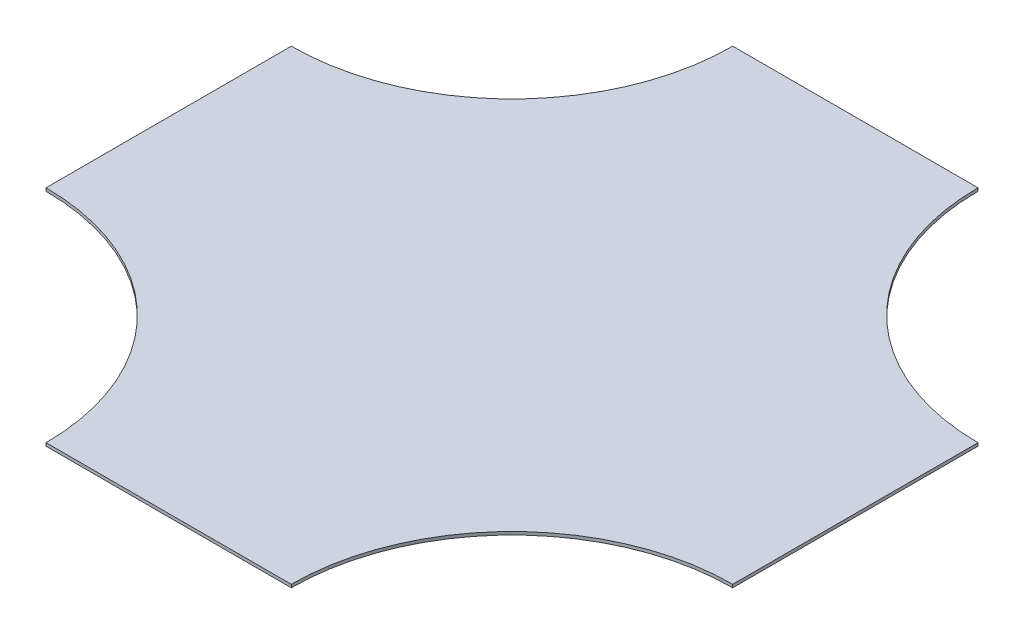
ISO-10303-21;
HEADER;
FILE_DESCRIPTION(('STEP AP214'),'2;1');
FILE_NAME('part.step','',(''),(''),'','','');
FILE_SCHEMA(('AUTOMOTIVE_DESIGN { 1 0 10303 214 1 1 1 1 }'));
ENDSEC;
DATA;
#1=APPLICATION_CONTEXT('core data for automotive mechanical design processes');
#2=APPLICATION_PROTOCOL_DEFINITION('international standard','automotive_design',2000,#1);
#3=PRODUCT_CONTEXT('',#1,'mechanical');
#4=PRODUCT('Part','Part','',(#3));
#5=PRODUCT_RELATED_PRODUCT_CATEGORY('part','',(#4));
#6=PRODUCT_DEFINITION_FORMATION('','',#4);
#7=PRODUCT_DEFINITION_CONTEXT('part definition',#1,'design');
#8=PRODUCT_DEFINITION('design','',#6,#7);
#9=PRODUCT_DEFINITION_SHAPE('','',#8);
#10=(LENGTH_UNIT() NAMED_UNIT(*) SI_UNIT(.MILLI.,.METRE.));
#11=(NAMED_UNIT(*) PLANE_ANGLE_UNIT() SI_UNIT($,.RADIAN.));
#12=(NAMED_UNIT(*) SI_UNIT($,.STERADIAN.) SOLID_ANGLE_UNIT());
#13=UNCERTAINTY_MEASURE_WITH_UNIT(LENGTH_MEASURE(1.E-05),#10,'distance_accuracy_value','');
#14=(GEOMETRIC_REPRESENTATION_CONTEXT(3) GLOBAL_UNCERTAINTY_ASSIGNED_CONTEXT((#13)) GLOBAL_UNIT_ASSIGNED_CONTEXT((#10,
#11,#12)) REPRESENTATION_CONTEXT('',''));
#15=CARTESIAN_POINT('',(0.,0.,0.));
#16=DIRECTION('',(0.,0.,1.));
#17=DIRECTION('',(1.,0.,0.));
#18=AXIS2_PLACEMENT_3D('',#15,#16,#17);
#19=CARTESIAN_POINT('',(-355.6,3.175,-355.6));
#20=DIRECTION('',(0.,-1.,0.));
#21=DIRECTION('',(0.,0.,-1.));
#22=AXIS2_PLACEMENT_3D('',#19,#20,#21);
#23=CYLINDRICAL_SURFACE('',#22,228.6);
#24=CARTESIAN_POINT('',(-355.6,0.,-355.6));
#25=DIRECTION('',(0.,-1.,0.));
#26=DIRECTION('',(0.,0.,1.));
#27=AXIS2_PLACEMENT_3D('',#24,#25,#26);
#28=CIRCLE('',#27,228.6);
#29=CARTESIAN_POINT('',(-127.,0.,-355.6));
#30=VERTEX_POINT('',#29);
#31=CARTESIAN_POINT('',(-355.6,0.,-127.));
#32=VERTEX_POINT('',#31);
#33=EDGE_CURVE('E131',#30,#32,#28,.T.);
#34=ORIENTED_EDGE('',*,*,#33,.T.);
#35=DIRECTION('',(0.,-1.,0.));
#36=VECTOR('',#35,1.);
#37=CARTESIAN_POINT('',(-355.6,3.175,-127.));
#38=LINE('',#37,#36);
#39=CARTESIAN_POINT('',(-355.6,3.175,-127.));
#40=VERTEX_POINT('',#39);
#41=EDGE_CURVE('E11',#40,#32,#38,.T.);
#42=ORIENTED_EDGE('',*,*,#41,.F.);
#43=CARTESIAN_POINT('',(-355.6,3.175,-355.6));
#44=DIRECTION('',(0.,-1.,0.));
#45=DIRECTION('',(0.,0.,1.));
#46=AXIS2_PLACEMENT_3D('',#43,#44,#45);
#47=CIRCLE('',#46,228.6);
#48=CARTESIAN_POINT('',(-127.,3.175,-355.6));
#49=VERTEX_POINT('',#48);
#50=EDGE_CURVE('E145',#49,#40,#47,.T.);
#51=ORIENTED_EDGE('',*,*,#50,.F.);
#52=DIRECTION('',(0.,-1.,0.));
#53=VECTOR('',#52,1.);
#54=CARTESIAN_POINT('',(-127.,3.175,-355.6));
#55=LINE('',#54,#53);
#56=EDGE_CURVE('E127',#49,#30,#55,.T.);
#57=ORIENTED_EDGE('',*,*,#56,.T.);
#58=EDGE_LOOP('',(#34,#42,#51,#57));
#59=FACE_BOUND('',#58,.T.);
#60=ADVANCED_FACE('F35',(#59),#23,.F.);
#61=CARTESIAN_POINT('',(-355.6,3.175,127.));
#62=DIRECTION('',(1.,0.,0.));
#63=DIRECTION('',(0.,0.,-1.));
#64=AXIS2_PLACEMENT_3D('',#61,#62,#63);
#65=PLANE('',#64);
#66=DIRECTION('',(0.,0.,1.));
#67=VECTOR('',#66,1.);
#68=CARTESIAN_POINT('',(-355.6,0.,127.));
#69=LINE('',#68,#67);
#70=CARTESIAN_POINT('',(-355.6,0.,127.));
#71=VERTEX_POINT('',#70);
#72=EDGE_CURVE('E134',#32,#71,#69,.T.);
#73=ORIENTED_EDGE('',*,*,#72,.T.);
#74=DIRECTION('',(0.,-1.,0.));
#75=VECTOR('',#74,1.);
#76=CARTESIAN_POINT('',(-355.6,3.175,127.));
#77=LINE('',#76,#75);
#78=CARTESIAN_POINT('',(-355.6,3.175,127.));
#79=VERTEX_POINT('',#78);
#80=EDGE_CURVE('E43',#79,#71,#77,.T.);
#81=ORIENTED_EDGE('',*,*,#80,.F.);
#82=DIRECTION('',(0.,0.,1.));
#83=VECTOR('',#82,1.);
#84=CARTESIAN_POINT('',(-355.6,3.175,127.));
#85=LINE('',#84,#83);
#86=EDGE_CURVE('E94',#40,#79,#85,.T.);
#87=ORIENTED_EDGE('',*,*,#86,.F.);
#88=ORIENTED_EDGE('',*,*,#41,.T.);
#89=EDGE_LOOP('',(#73,#81,#87,#88));
#90=FACE_BOUND('',#89,.T.);
#91=ADVANCED_FACE('F180',(#90),#65,.F.);
#92=CARTESIAN_POINT('',(-355.6,3.175,355.6));
#93=DIRECTION('',(0.,-1.,0.));
#94=DIRECTION('',(0.,0.,-1.));
#95=AXIS2_PLACEMENT_3D('',#92,#93,#94);
#96=CYLINDRICAL_SURFACE('',#95,228.6);
#97=CARTESIAN_POINT('',(-355.6,0.,355.6));
#98=DIRECTION('',(0.,-1.,0.));
#99=DIRECTION('',(0.,0.,1.));
#100=AXIS2_PLACEMENT_3D('',#97,#98,#99);
#101=CIRCLE('',#100,228.6);
#102=CARTESIAN_POINT('',(-127.,0.,355.6));
#103=VERTEX_POINT('',#102);
#104=EDGE_CURVE('E136',#71,#103,#101,.T.);
#105=ORIENTED_EDGE('',*,*,#104,.T.);
#106=DIRECTION('',(0.,-1.,0.));
#107=VECTOR('',#106,1.);
#108=CARTESIAN_POINT('',(-127.,3.175,355.6));
#109=LINE('',#108,#107);
#110=CARTESIAN_POINT('',(-127.,3.175,355.6));
#111=VERTEX_POINT('',#110);
#112=EDGE_CURVE('E152',#111,#103,#109,.T.);
#113=ORIENTED_EDGE('',*,*,#112,.F.);
#114=CARTESIAN_POINT('',(-355.6,3.175,355.6));
#115=DIRECTION('',(0.,-1.,0.));
#116=DIRECTION('',(0.,0.,1.));
#117=AXIS2_PLACEMENT_3D('',#114,#115,#116);
#118=CIRCLE('',#117,228.6);
#119=EDGE_CURVE('E160',#79,#111,#118,.T.);
#120=ORIENTED_EDGE('',*,*,#119,.F.);
#121=ORIENTED_EDGE('',*,*,#80,.T.);
#122=EDGE_LOOP('',(#105,#113,#120,#121));
#123=FACE_BOUND('',#122,.T.);
#124=ADVANCED_FACE('F158',(#123),#96,.F.);
#125=CARTESIAN_POINT('',(-127.,3.175,355.6));
#126=DIRECTION('',(0.,0.,-1.));
#127=DIRECTION('',(-1.,0.,0.));
#128=AXIS2_PLACEMENT_3D('',#125,#126,#127);
#129=PLANE('',#128);
#130=DIRECTION('',(1.,0.,0.));
#131=VECTOR('',#130,1.);
#132=CARTESIAN_POINT('',(-127.,0.,355.6));
#133=LINE('',#132,#131);
#134=CARTESIAN_POINT('',(127.,0.,355.6));
#135=VERTEX_POINT('',#134);
#136=EDGE_CURVE('E138',#103,#135,#133,.T.);
#137=ORIENTED_EDGE('',*,*,#136,.T.);
#138=DIRECTION('',(0.,-1.,0.));
#139=VECTOR('',#138,1.);
#140=CARTESIAN_POINT('',(127.,3.175,355.6));
#141=LINE('',#140,#139);
#142=CARTESIAN_POINT('',(127.,3.175,355.6));
#143=VERTEX_POINT('',#142);
#144=EDGE_CURVE('E149',#143,#135,#141,.T.);
#145=ORIENTED_EDGE('',*,*,#144,.F.);
#146=DIRECTION('',(1.,0.,0.));
#147=VECTOR('',#146,1.);
#148=CARTESIAN_POINT('',(-127.,3.175,355.6));
#149=LINE('',#148,#147);
#150=EDGE_CURVE('E172',#111,#143,#149,.T.);
#151=ORIENTED_EDGE('',*,*,#150,.F.);
#152=ORIENTED_EDGE('',*,*,#112,.T.);
#153=EDGE_LOOP('',(#137,#145,#151,#152));
#154=FACE_BOUND('',#153,.T.);
#155=ADVANCED_FACE('F168',(#154),#129,.F.);
#156=CARTESIAN_POINT('',(355.6,3.175,355.6));
#157=DIRECTION('',(0.,-1.,0.));
#158=DIRECTION('',(0.,0.,-1.));
#159=AXIS2_PLACEMENT_3D('',#156,#157,#158);
#160=CYLINDRICAL_SURFACE('',#159,228.6);
#161=CARTESIAN_POINT('',(355.6,0.,355.6));
#162=DIRECTION('',(0.,-1.,0.));
#163=DIRECTION('',(0.,0.,1.));
#164=AXIS2_PLACEMENT_3D('',#161,#162,#163);
#165=CIRCLE('',#164,228.6);
#166=CARTESIAN_POINT('',(355.6,0.,127.));
#167=VERTEX_POINT('',#166);
#168=EDGE_CURVE('E140',#135,#167,#165,.T.);
#169=ORIENTED_EDGE('',*,*,#168,.T.);
#170=DIRECTION('',(0.,-1.,0.));
#171=VECTOR('',#170,1.);
#172=CARTESIAN_POINT('',(355.6,3.175,127.));
#173=LINE('',#172,#171);
#174=CARTESIAN_POINT('',(355.6,3.175,127.));
#175=VERTEX_POINT('',#174);
#176=EDGE_CURVE('E122',#175,#167,#173,.T.);
#177=ORIENTED_EDGE('',*,*,#176,.F.);
#178=CARTESIAN_POINT('',(355.6,3.175,355.6));
#179=DIRECTION('',(0.,-1.,0.));
#180=DIRECTION('',(0.,0.,1.));
#181=AXIS2_PLACEMENT_3D('',#178,#179,#180);
#182=CIRCLE('',#181,228.6);
#183=EDGE_CURVE('E113',#143,#175,#182,.T.);
#184=ORIENTED_EDGE('',*,*,#183,.F.);
#185=ORIENTED_EDGE('',*,*,#144,.T.);
#186=EDGE_LOOP('',(#169,#177,#184,#185));
#187=FACE_BOUND('',#186,.T.);
#188=ADVANCED_FACE('F171',(#187),#160,.F.);
#189=CARTESIAN_POINT('',(355.6,3.175,127.));
#190=DIRECTION('',(-1.,0.,0.));
#191=DIRECTION('',(0.,0.,1.));
#192=AXIS2_PLACEMENT_3D('',#189,#190,#191);
#193=PLANE('',#192);
#194=DIRECTION('',(0.,0.,-1.));
#195=VECTOR('',#194,1.);
#196=CARTESIAN_POINT('',(355.6,0.,127.));
#197=LINE('',#196,#195);
#198=CARTESIAN_POINT('',(355.6,0.,-127.));
#199=VERTEX_POINT('',#198);
#200=EDGE_CURVE('E121',#167,#199,#197,.T.);
#201=ORIENTED_EDGE('',*,*,#200,.T.);
#202=DIRECTION('',(0.,-1.,0.));
#203=VECTOR('',#202,1.);
#204=CARTESIAN_POINT('',(355.6,3.175,-127.));
#205=LINE('',#204,#203);
#206=CARTESIAN_POINT('',(355.6,3.175,-127.));
#207=VERTEX_POINT('',#206);
#208=EDGE_CURVE('E118',#207,#199,#205,.T.);
#209=ORIENTED_EDGE('',*,*,#208,.F.);
#210=DIRECTION('',(0.,0.,-1.));
#211=VECTOR('',#210,1.);
#212=CARTESIAN_POINT('',(355.6,3.175,127.));
#213=LINE('',#212,#211);
#214=EDGE_CURVE('E107',#175,#207,#213,.T.);
#215=ORIENTED_EDGE('',*,*,#214,.F.);
#216=ORIENTED_EDGE('',*,*,#176,.T.);
#217=EDGE_LOOP('',(#201,#209,#215,#216));
#218=FACE_BOUND('',#217,.T.);
#219=ADVANCED_FACE('F119',(#218),#193,.F.);
#220=CARTESIAN_POINT('',(355.6,3.175,-355.6));
#221=DIRECTION('',(0.,-1.,0.));
#222=DIRECTION('',(0.,0.,-1.));
#223=AXIS2_PLACEMENT_3D('',#220,#221,#222);
#224=CYLINDRICAL_SURFACE('',#223,228.6);
#225=CARTESIAN_POINT('',(355.6,0.,-355.6));
#226=DIRECTION('',(0.,-1.,0.));
#227=DIRECTION('',(0.,0.,1.));
#228=AXIS2_PLACEMENT_3D('',#225,#226,#227);
#229=CIRCLE('',#228,228.6);
#230=CARTESIAN_POINT('',(127.,0.,-355.6));
#231=VERTEX_POINT('',#230);
#232=EDGE_CURVE('E80',#199,#231,#229,.T.);
#233=ORIENTED_EDGE('',*,*,#232,.T.);
#234=DIRECTION('',(0.,-1.,0.));
#235=VECTOR('',#234,1.);
#236=CARTESIAN_POINT('',(127.,3.175,-355.6));
#237=LINE('',#236,#235);
#238=CARTESIAN_POINT('',(127.,3.175,-355.6));
#239=VERTEX_POINT('',#238);
#240=EDGE_CURVE('E123',#239,#231,#237,.T.);
#241=ORIENTED_EDGE('',*,*,#240,.F.);
#242=CARTESIAN_POINT('',(355.6,3.175,-355.6));
#243=DIRECTION('',(0.,-1.,0.));
#244=DIRECTION('',(0.,0.,1.));
#245=AXIS2_PLACEMENT_3D('',#242,#243,#244);
#246=CIRCLE('',#245,228.6);
#247=EDGE_CURVE('E111',#207,#239,#246,.T.);
#248=ORIENTED_EDGE('',*,*,#247,.F.);
#249=ORIENTED_EDGE('',*,*,#208,.T.);
#250=EDGE_LOOP('',(#233,#241,#248,#249));
#251=FACE_BOUND('',#250,.T.);
#252=ADVANCED_FACE('F125',(#251),#224,.F.);
#253=CARTESIAN_POINT('',(-127.,3.175,-355.6));
#254=DIRECTION('',(0.,0.,1.));
#255=DIRECTION('',(1.,0.,0.));
#256=AXIS2_PLACEMENT_3D('',#253,#254,#255);
#257=PLANE('',#256);
#258=DIRECTION('',(-1.,0.,0.));
#259=VECTOR('',#258,1.);
#260=CARTESIAN_POINT('',(-127.,0.,-355.6));
#261=LINE('',#260,#259);
#262=EDGE_CURVE('E86',#231,#30,#261,.T.);
#263=ORIENTED_EDGE('',*,*,#262,.T.);
#264=ORIENTED_EDGE('',*,*,#56,.F.);
#265=DIRECTION('',(-1.,0.,0.));
#266=VECTOR('',#265,1.);
#267=CARTESIAN_POINT('',(-127.,3.175,-355.6));
#268=LINE('',#267,#266);
#269=EDGE_CURVE('E51',#239,#49,#268,.T.);
#270=ORIENTED_EDGE('',*,*,#269,.F.);
#271=ORIENTED_EDGE('',*,*,#240,.T.);
#272=EDGE_LOOP('',(#263,#264,#270,#271));
#273=FACE_BOUND('',#272,.T.);
#274=ADVANCED_FACE('F196',(#273),#257,.F.);
#275=CARTESIAN_POINT('',(-355.6,3.175,-355.6));
#276=DIRECTION('',(0.,1.,0.));
#277=DIRECTION('',(0.,0.,1.));
#278=AXIS2_PLACEMENT_3D('',#275,#276,#277);
#279=PLANE('',#278);
#280=ORIENTED_EDGE('',*,*,#50,.T.);
#281=ORIENTED_EDGE('',*,*,#86,.T.);
#282=ORIENTED_EDGE('',*,*,#119,.T.);
#283=ORIENTED_EDGE('',*,*,#150,.T.);
#284=ORIENTED_EDGE('',*,*,#183,.T.);
#285=ORIENTED_EDGE('',*,*,#214,.T.);
#286=ORIENTED_EDGE('',*,*,#247,.T.);
#287=ORIENTED_EDGE('',*,*,#269,.T.);
#288=EDGE_LOOP('',(#280,#281,#282,#283,#284,#285,#286,#287));
#289=FACE_BOUND('',#288,.T.);
#290=ADVANCED_FACE('F109',(#289),#279,.T.);
#291=CARTESIAN_POINT('',(-355.6,0.,-355.6));
#292=DIRECTION('',(0.,1.,0.));
#293=DIRECTION('',(0.,0.,1.));
#294=AXIS2_PLACEMENT_3D('',#291,#292,#293);
#295=PLANE('',#294);
#296=ORIENTED_EDGE('',*,*,#33,.F.);
#297=ORIENTED_EDGE('',*,*,#262,.F.);
#298=ORIENTED_EDGE('',*,*,#232,.F.);
#299=ORIENTED_EDGE('',*,*,#200,.F.);
#300=ORIENTED_EDGE('',*,*,#168,.F.);
#301=ORIENTED_EDGE('',*,*,#136,.F.);
#302=ORIENTED_EDGE('',*,*,#104,.F.);
#303=ORIENTED_EDGE('',*,*,#72,.F.);
#304=EDGE_LOOP('',(#296,#297,#298,#299,#300,#301,#302,#303));
#305=FACE_BOUND('',#304,.T.);
#306=ADVANCED_FACE('F164',(#305),#295,.F.);
#307=CLOSED_SHELL('',(#60,#91,#124,#155,#188,#219,#252,#274,#290,#306));
#308=MANIFOLD_SOLID_BREP('B2',#307);
#309=ADVANCED_BREP_SHAPE_REPRESENTATION('',(#18,#308),#14);
#310=SHAPE_DEFINITION_REPRESENTATION(#9,#309);
ENDSEC;
END-ISO-10303-21;
